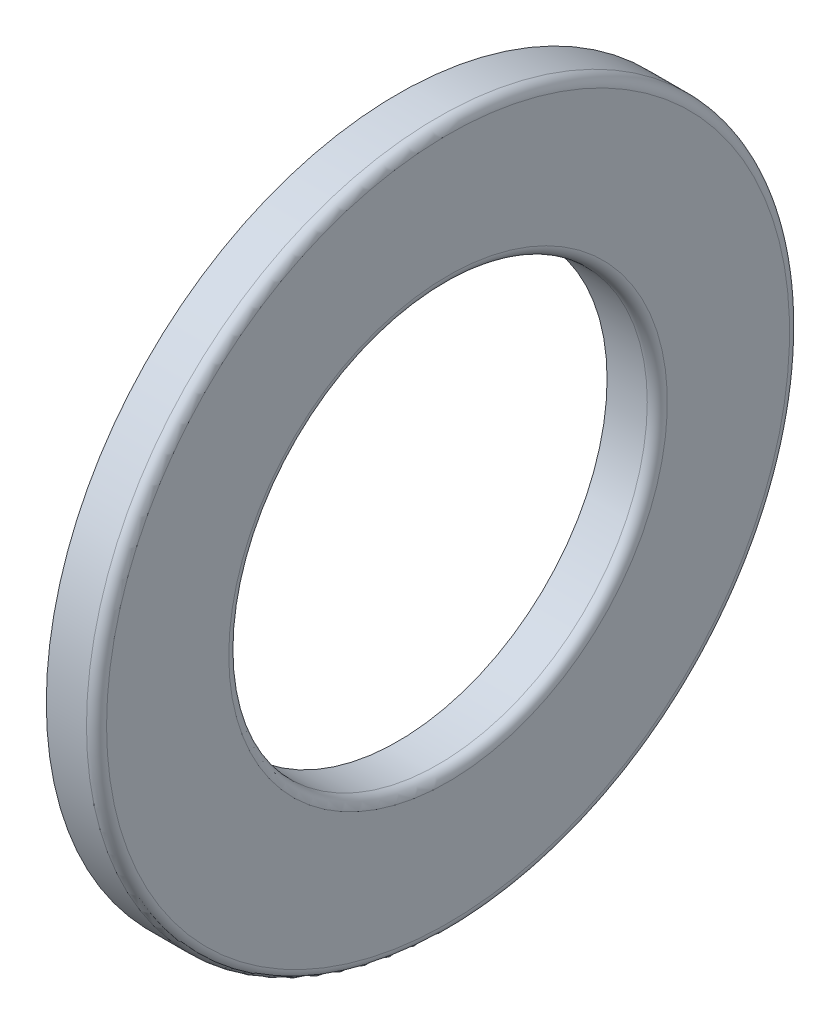
ISO-10303-21;
HEADER;
FILE_DESCRIPTION(('STEP AP214'),'2;1');
FILE_NAME('part.step','',(''),(''),'','','');
FILE_SCHEMA(('AUTOMOTIVE_DESIGN { 1 0 10303 214 1 1 1 1 }'));
ENDSEC;
DATA;
#1=APPLICATION_CONTEXT('core data for automotive mechanical design processes');
#2=APPLICATION_PROTOCOL_DEFINITION('international standard','automotive_design',2000,#1);
#3=PRODUCT_CONTEXT('',#1,'mechanical');
#4=PRODUCT('Part','Part','',(#3));
#5=PRODUCT_RELATED_PRODUCT_CATEGORY('part','',(#4));
#6=PRODUCT_DEFINITION_FORMATION('','',#4);
#7=PRODUCT_DEFINITION_CONTEXT('part definition',#1,'design');
#8=PRODUCT_DEFINITION('design','',#6,#7);
#9=PRODUCT_DEFINITION_SHAPE('','',#8);
#10=(LENGTH_UNIT() NAMED_UNIT(*) SI_UNIT(.MILLI.,.METRE.));
#11=(NAMED_UNIT(*) PLANE_ANGLE_UNIT() SI_UNIT($,.RADIAN.));
#12=(NAMED_UNIT(*) SI_UNIT($,.STERADIAN.) SOLID_ANGLE_UNIT());
#13=UNCERTAINTY_MEASURE_WITH_UNIT(LENGTH_MEASURE(1.E-05),#10,'distance_accuracy_value','');
#14=(GEOMETRIC_REPRESENTATION_CONTEXT(3) GLOBAL_UNCERTAINTY_ASSIGNED_CONTEXT((#13)) GLOBAL_UNIT_ASSIGNED_CONTEXT((#10,
#11,#12)) REPRESENTATION_CONTEXT('',''));
#15=CARTESIAN_POINT('',(0.,0.,0.));
#16=DIRECTION('',(0.,0.,1.));
#17=DIRECTION('',(1.,0.,0.));
#18=AXIS2_PLACEMENT_3D('',#15,#16,#17);
#19=CARTESIAN_POINT('',(10.4,0.,0.));
#20=DIRECTION('',(-1.,0.,0.));
#21=DIRECTION('',(0.,0.,1.));
#22=AXIS2_PLACEMENT_3D('',#19,#20,#21);
#23=TOROIDAL_SURFACE('',#22,13.1,0.6);
#24=CARTESIAN_POINT('',(11.,0.,0.));
#25=DIRECTION('',(-1.,0.,0.));
#26=DIRECTION('',(0.,0.,1.));
#27=AXIS2_PLACEMENT_3D('',#24,#25,#26);
#28=CIRCLE('',#27,13.1);
#29=CARTESIAN_POINT('',(11.,0.,13.1));
#30=VERTEX_POINT('',#29);
#31=EDGE_CURVE('E10',#30,#30,#28,.T.);
#32=ORIENTED_EDGE('',*,*,#31,.F.);
#33=EDGE_LOOP('',(#32));
#34=FACE_BOUND('',#33,.T.);
#35=CARTESIAN_POINT('',(10.4,0.,0.));
#36=DIRECTION('',(-1.,0.,0.));
#37=DIRECTION('',(0.,0.,1.));
#38=AXIS2_PLACEMENT_3D('',#35,#36,#37);
#39=CIRCLE('',#38,12.5);
#40=CARTESIAN_POINT('',(10.4,0.,12.5));
#41=VERTEX_POINT('',#40);
#42=EDGE_CURVE('E49',#41,#41,#39,.T.);
#43=ORIENTED_EDGE('',*,*,#42,.T.);
#44=EDGE_LOOP('',(#43));
#45=FACE_BOUND('',#44,.T.);
#46=ADVANCED_FACE('F15',(#34,#45),#23,.T.);
#47=CARTESIAN_POINT('',(11.,13.1,0.));
#48=DIRECTION('',(-1.,0.,0.));
#49=DIRECTION('',(0.,0.,1.));
#50=AXIS2_PLACEMENT_3D('',#47,#48,#49);
#51=PLANE('',#50);
#52=CARTESIAN_POINT('',(11.,0.,0.));
#53=DIRECTION('',(-1.,0.,0.));
#54=DIRECTION('',(0.,0.,1.));
#55=AXIS2_PLACEMENT_3D('',#52,#53,#54);
#56=CIRCLE('',#55,20.4);
#57=CARTESIAN_POINT('',(11.,0.,20.4));
#58=VERTEX_POINT('',#57);
#59=EDGE_CURVE('E22',#58,#58,#56,.T.);
#60=ORIENTED_EDGE('',*,*,#59,.F.);
#61=EDGE_LOOP('',(#60));
#62=FACE_BOUND('',#61,.T.);
#63=ORIENTED_EDGE('',*,*,#31,.T.);
#64=EDGE_LOOP('',(#63));
#65=FACE_BOUND('',#64,.T.);
#66=ADVANCED_FACE('F75',(#62,#65),#51,.F.);
#67=CARTESIAN_POINT('',(10.4,0.,0.));
#68=DIRECTION('',(-1.,0.,0.));
#69=DIRECTION('',(0.,0.,1.));
#70=AXIS2_PLACEMENT_3D('',#67,#68,#69);
#71=TOROIDAL_SURFACE('',#70,20.4,0.6);
#72=CARTESIAN_POINT('',(10.4,0.,0.));
#73=DIRECTION('',(-1.,0.,0.));
#74=DIRECTION('',(0.,0.,1.));
#75=AXIS2_PLACEMENT_3D('',#72,#73,#74);
#76=CIRCLE('',#75,21.);
#77=CARTESIAN_POINT('',(10.4,0.,21.));
#78=VERTEX_POINT('',#77);
#79=EDGE_CURVE('E31',#78,#78,#76,.T.);
#80=ORIENTED_EDGE('',*,*,#79,.F.);
#81=EDGE_LOOP('',(#80));
#82=FACE_BOUND('',#81,.T.);
#83=ORIENTED_EDGE('',*,*,#59,.T.);
#84=EDGE_LOOP('',(#83));
#85=FACE_BOUND('',#84,.T.);
#86=ADVANCED_FACE('F70',(#82,#85),#71,.T.);
#87=CARTESIAN_POINT('',(8.,0.,0.));
#88=DIRECTION('',(-1.,0.,0.));
#89=DIRECTION('',(0.,0.,1.));
#90=AXIS2_PLACEMENT_3D('',#87,#88,#89);
#91=CYLINDRICAL_SURFACE('',#90,21.);
#92=CARTESIAN_POINT('',(8.,0.,0.));
#93=DIRECTION('',(-1.,0.,0.));
#94=DIRECTION('',(0.,0.,1.));
#95=AXIS2_PLACEMENT_3D('',#92,#93,#94);
#96=CIRCLE('',#95,21.);
#97=CARTESIAN_POINT('',(8.,0.,21.));
#98=VERTEX_POINT('',#97);
#99=EDGE_CURVE('E39',#98,#98,#96,.T.);
#100=ORIENTED_EDGE('',*,*,#99,.F.);
#101=EDGE_LOOP('',(#100));
#102=FACE_BOUND('',#101,.T.);
#103=ORIENTED_EDGE('',*,*,#79,.T.);
#104=EDGE_LOOP('',(#103));
#105=FACE_BOUND('',#104,.T.);
#106=ADVANCED_FACE('F64',(#102,#105),#91,.T.);
#107=CARTESIAN_POINT('',(8.,21.,0.));
#108=DIRECTION('',(1.,0.,0.));
#109=DIRECTION('',(0.,0.,-1.));
#110=AXIS2_PLACEMENT_3D('',#107,#108,#109);
#111=PLANE('',#110);
#112=CARTESIAN_POINT('',(8.,0.,0.));
#113=DIRECTION('',(-1.,0.,0.));
#114=DIRECTION('',(0.,0.,1.));
#115=AXIS2_PLACEMENT_3D('',#112,#113,#114);
#116=CIRCLE('',#115,12.5);
#117=CARTESIAN_POINT('',(8.,0.,12.5));
#118=VERTEX_POINT('',#117);
#119=EDGE_CURVE('E45',#118,#118,#116,.T.);
#120=ORIENTED_EDGE('',*,*,#119,.F.);
#121=EDGE_LOOP('',(#120));
#122=FACE_BOUND('',#121,.T.);
#123=ORIENTED_EDGE('',*,*,#99,.T.);
#124=EDGE_LOOP('',(#123));
#125=FACE_BOUND('',#124,.T.);
#126=ADVANCED_FACE('F58',(#122,#125),#111,.F.);
#127=CARTESIAN_POINT('',(8.,0.,0.));
#128=DIRECTION('',(-1.,0.,0.));
#129=DIRECTION('',(0.,0.,1.));
#130=AXIS2_PLACEMENT_3D('',#127,#128,#129);
#131=CYLINDRICAL_SURFACE('',#130,12.5);
#132=ORIENTED_EDGE('',*,*,#42,.F.);
#133=EDGE_LOOP('',(#132));
#134=FACE_BOUND('',#133,.T.);
#135=ORIENTED_EDGE('',*,*,#119,.T.);
#136=EDGE_LOOP('',(#135));
#137=FACE_BOUND('',#136,.T.);
#138=ADVANCED_FACE('F55',(#134,#137),#131,.F.);
#139=CLOSED_SHELL('',(#46,#66,#86,#106,#126,#138));
#140=MANIFOLD_SOLID_BREP('B1',#139);
#141=ADVANCED_BREP_SHAPE_REPRESENTATION('',(#18,#140),#14);
#142=SHAPE_DEFINITION_REPRESENTATION(#9,#141);
ENDSEC;
END-ISO-10303-21;
